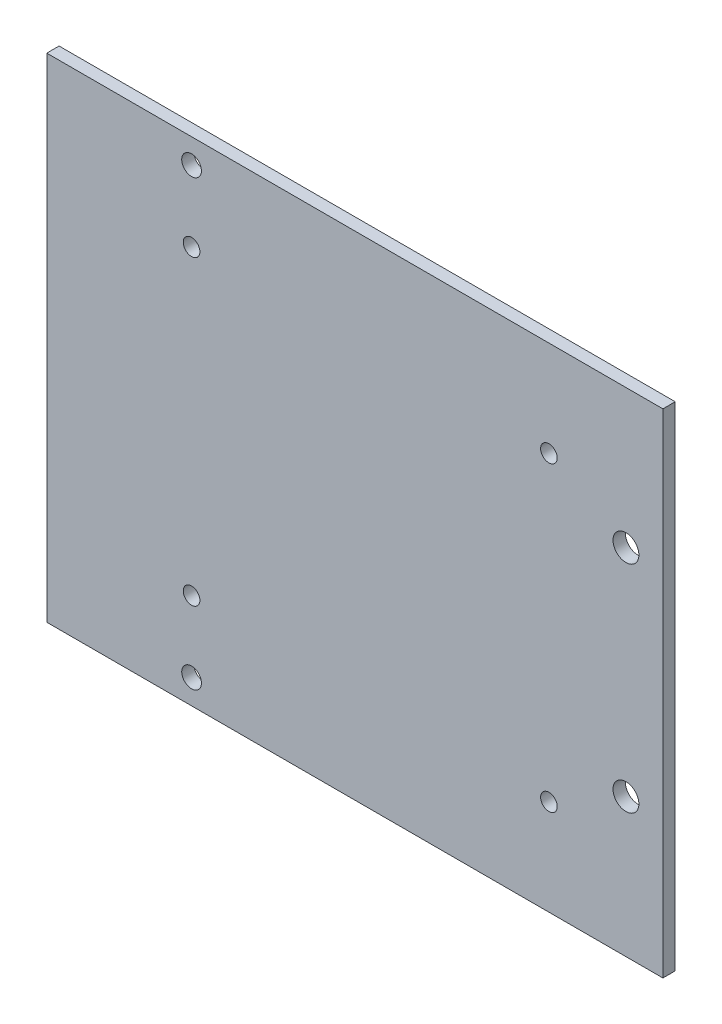
ISO-10303-21;
HEADER;
FILE_DESCRIPTION(('STEP AP214'),'2;1');
FILE_NAME('part.step','',(''),(''),'','','');
FILE_SCHEMA(('AUTOMOTIVE_DESIGN { 1 0 10303 214 1 1 1 1 }'));
ENDSEC;
DATA;
#1=APPLICATION_CONTEXT('core data for automotive mechanical design processes');
#2=APPLICATION_PROTOCOL_DEFINITION('international standard','automotive_design',2000,#1);
#3=PRODUCT_CONTEXT('',#1,'mechanical');
#4=PRODUCT('Part','Part','',(#3));
#5=PRODUCT_RELATED_PRODUCT_CATEGORY('part','',(#4));
#6=PRODUCT_DEFINITION_FORMATION('','',#4);
#7=PRODUCT_DEFINITION_CONTEXT('part definition',#1,'design');
#8=PRODUCT_DEFINITION('design','',#6,#7);
#9=PRODUCT_DEFINITION_SHAPE('','',#8);
#10=(LENGTH_UNIT() NAMED_UNIT(*) SI_UNIT(.MILLI.,.METRE.));
#11=(NAMED_UNIT(*) PLANE_ANGLE_UNIT() SI_UNIT($,.RADIAN.));
#12=(NAMED_UNIT(*) SI_UNIT($,.STERADIAN.) SOLID_ANGLE_UNIT());
#13=UNCERTAINTY_MEASURE_WITH_UNIT(LENGTH_MEASURE(1.E-05),#10,'distance_accuracy_value','');
#14=(GEOMETRIC_REPRESENTATION_CONTEXT(3) GLOBAL_UNCERTAINTY_ASSIGNED_CONTEXT((#13)) GLOBAL_UNIT_ASSIGNED_CONTEXT((#10,
#11,#12)) REPRESENTATION_CONTEXT('',''));
#15=CARTESIAN_POINT('',(0.,0.,0.));
#16=DIRECTION('',(0.,0.,1.));
#17=DIRECTION('',(1.,0.,0.));
#18=AXIS2_PLACEMENT_3D('',#15,#16,#17);
#19=CARTESIAN_POINT('',(0.,0.,2.));
#20=DIRECTION('',(0.,0.,1.));
#21=DIRECTION('',(1.,0.,0.));
#22=AXIS2_PLACEMENT_3D('',#19,#20,#21);
#23=PLANE('',#22);
#24=CARTESIAN_POINT('',(44.,-17.5,2.));
#25=DIRECTION('',(0.,0.,1.));
#26=DIRECTION('',(1.,0.,0.));
#27=AXIS2_PLACEMENT_3D('',#24,#25,#26);
#28=CIRCLE('',#27,2.09999999999999);
#29=CARTESIAN_POINT('',(46.1,-17.5,2.));
#30=VERTEX_POINT('',#29);
#31=EDGE_CURVE('E117',#30,#30,#28,.F.);
#32=ORIENTED_EDGE('',*,*,#31,.T.);
#33=EDGE_LOOP('',(#32));
#34=FACE_BOUND('',#33,.T.);
#35=CARTESIAN_POINT('',(-26.5,36.,2.));
#36=DIRECTION('',(0.,0.,1.));
#37=DIRECTION('',(1.,0.,0.));
#38=AXIS2_PLACEMENT_3D('',#35,#36,#37);
#39=CIRCLE('',#38,1.6);
#40=CARTESIAN_POINT('',(-24.9,36.,2.));
#41=VERTEX_POINT('',#40);
#42=EDGE_CURVE('E115',#41,#41,#39,.T.);
#43=ORIENTED_EDGE('',*,*,#42,.F.);
#44=EDGE_LOOP('',(#43));
#45=FACE_BOUND('',#44,.T.);
#46=CARTESIAN_POINT('',(-26.4999999999728,-36.0000000000007,2.));
#47=DIRECTION('',(0.,0.,-1.));
#48=DIRECTION('',(-1.,0.,0.));
#49=AXIS2_PLACEMENT_3D('',#46,#47,#48);
#50=CIRCLE('',#49,1.60000000001161);
#51=CARTESIAN_POINT('',(-28.0999999999844,-36.0000000000007,2.));
#52=VERTEX_POINT('',#51);
#53=EDGE_CURVE('E130',#52,#52,#50,.T.);
#54=ORIENTED_EDGE('',*,*,#53,.T.);
#55=EDGE_LOOP('',(#54));
#56=FACE_BOUND('',#55,.T.);
#57=CARTESIAN_POINT('',(-26.5,24.5,2.));
#58=DIRECTION('',(0.,0.,1.));
#59=DIRECTION('',(1.,0.,0.));
#60=AXIS2_PLACEMENT_3D('',#57,#58,#59);
#61=CIRCLE('',#60,1.35);
#62=CARTESIAN_POINT('',(-25.15,24.5,2.));
#63=VERTEX_POINT('',#62);
#64=EDGE_CURVE('E140',#63,#63,#61,.F.);
#65=ORIENTED_EDGE('',*,*,#64,.T.);
#66=EDGE_LOOP('',(#65));
#67=FACE_BOUND('',#66,.T.);
#68=CARTESIAN_POINT('',(-26.5,-24.5,2.));
#69=DIRECTION('',(0.,0.,1.));
#70=DIRECTION('',(1.,0.,0.));
#71=AXIS2_PLACEMENT_3D('',#68,#69,#70);
#72=CIRCLE('',#71,1.35);
#73=CARTESIAN_POINT('',(-25.15,-24.5,2.));
#74=VERTEX_POINT('',#73);
#75=EDGE_CURVE('E139',#74,#74,#72,.T.);
#76=ORIENTED_EDGE('',*,*,#75,.F.);
#77=EDGE_LOOP('',(#76));
#78=FACE_BOUND('',#77,.T.);
#79=DIRECTION('',(0.,1.,0.));
#80=VECTOR('',#79,1.);
#81=CARTESIAN_POINT('',(50.,40.,2.));
#82=LINE('',#81,#80);
#83=CARTESIAN_POINT('',(50.,-40.,2.));
#84=VERTEX_POINT('',#83);
#85=CARTESIAN_POINT('',(50.,40.,2.));
#86=VERTEX_POINT('',#85);
#87=EDGE_CURVE('E88',#84,#86,#82,.T.);
#88=ORIENTED_EDGE('',*,*,#87,.T.);
#89=DIRECTION('',(-1.,0.,0.));
#90=VECTOR('',#89,1.);
#91=CARTESIAN_POINT('',(-50.,40.,2.));
#92=LINE('',#91,#90);
#93=CARTESIAN_POINT('',(-50.,40.,2.));
#94=VERTEX_POINT('',#93);
#95=EDGE_CURVE('E83',#86,#94,#92,.T.);
#96=ORIENTED_EDGE('',*,*,#95,.T.);
#97=DIRECTION('',(0.,-1.,0.));
#98=VECTOR('',#97,1.);
#99=CARTESIAN_POINT('',(-50.,40.,2.));
#100=LINE('',#99,#98);
#101=CARTESIAN_POINT('',(-50.,-40.,2.));
#102=VERTEX_POINT('',#101);
#103=EDGE_CURVE('E86',#94,#102,#100,.T.);
#104=ORIENTED_EDGE('',*,*,#103,.T.);
#105=DIRECTION('',(1.,0.,0.));
#106=VECTOR('',#105,1.);
#107=CARTESIAN_POINT('',(-50.,-40.,2.));
#108=LINE('',#107,#106);
#109=EDGE_CURVE('E53',#102,#84,#108,.T.);
#110=ORIENTED_EDGE('',*,*,#109,.T.);
#111=EDGE_LOOP('',(#88,#96,#104,#110));
#112=FACE_BOUND('',#111,.T.);
#113=CARTESIAN_POINT('',(31.5,24.5,2.));
#114=DIRECTION('',(0.,0.,1.));
#115=DIRECTION('',(1.,0.,0.));
#116=AXIS2_PLACEMENT_3D('',#113,#114,#115);
#117=CIRCLE('',#116,1.35000000000001);
#118=CARTESIAN_POINT('',(32.85,24.5,2.));
#119=VERTEX_POINT('',#118);
#120=EDGE_CURVE('E146',#119,#119,#117,.T.);
#121=ORIENTED_EDGE('',*,*,#120,.F.);
#122=EDGE_LOOP('',(#121));
#123=FACE_BOUND('',#122,.T.);
#124=CARTESIAN_POINT('',(31.5,-24.5,2.));
#125=DIRECTION('',(0.,0.,1.));
#126=DIRECTION('',(1.,0.,0.));
#127=AXIS2_PLACEMENT_3D('',#124,#125,#126);
#128=CIRCLE('',#127,1.35000000000001);
#129=CARTESIAN_POINT('',(32.85,-24.5,2.));
#130=VERTEX_POINT('',#129);
#131=EDGE_CURVE('E133',#130,#130,#128,.F.);
#132=ORIENTED_EDGE('',*,*,#131,.T.);
#133=EDGE_LOOP('',(#132));
#134=FACE_BOUND('',#133,.T.);
#135=CARTESIAN_POINT('',(44.,17.5,2.));
#136=DIRECTION('',(0.,0.,1.));
#137=DIRECTION('',(1.,0.,0.));
#138=AXIS2_PLACEMENT_3D('',#135,#136,#137);
#139=CIRCLE('',#138,2.1);
#140=CARTESIAN_POINT('',(46.1,17.5,2.));
#141=VERTEX_POINT('',#140);
#142=EDGE_CURVE('E111',#141,#141,#139,.T.);
#143=ORIENTED_EDGE('',*,*,#142,.F.);
#144=EDGE_LOOP('',(#143));
#145=FACE_BOUND('',#144,.T.);
#146=ADVANCED_FACE('F34',(#34,#45,#56,#67,#78,#112,#123,#134,#145),#23,.T.);
#147=CARTESIAN_POINT('',(0.,0.,0.));
#148=DIRECTION('',(0.,0.,1.));
#149=DIRECTION('',(1.,0.,0.));
#150=AXIS2_PLACEMENT_3D('',#147,#148,#149);
#151=PLANE('',#150);
#152=CARTESIAN_POINT('',(31.5,-24.5,0.));
#153=DIRECTION('',(0.,0.,1.));
#154=DIRECTION('',(1.,0.,0.));
#155=AXIS2_PLACEMENT_3D('',#152,#153,#154);
#156=CIRCLE('',#155,1.35000000000001);
#157=CARTESIAN_POINT('',(32.85,-24.5,0.));
#158=VERTEX_POINT('',#157);
#159=EDGE_CURVE('E149',#158,#158,#156,.F.);
#160=ORIENTED_EDGE('',*,*,#159,.F.);
#161=EDGE_LOOP('',(#160));
#162=FACE_BOUND('',#161,.T.);
#163=CARTESIAN_POINT('',(-26.5,24.5,0.));
#164=DIRECTION('',(0.,0.,1.));
#165=DIRECTION('',(1.,0.,0.));
#166=AXIS2_PLACEMENT_3D('',#163,#164,#165);
#167=CIRCLE('',#166,1.35);
#168=CARTESIAN_POINT('',(-25.15,24.5,0.));
#169=VERTEX_POINT('',#168);
#170=EDGE_CURVE('E136',#169,#169,#167,.F.);
#171=ORIENTED_EDGE('',*,*,#170,.F.);
#172=EDGE_LOOP('',(#171));
#173=FACE_BOUND('',#172,.T.);
#174=DIRECTION('',(0.,1.,0.));
#175=VECTOR('',#174,1.);
#176=CARTESIAN_POINT('',(50.,40.,0.));
#177=LINE('',#176,#175);
#178=CARTESIAN_POINT('',(50.,-40.,0.));
#179=VERTEX_POINT('',#178);
#180=CARTESIAN_POINT('',(50.,40.,0.));
#181=VERTEX_POINT('',#180);
#182=EDGE_CURVE('E101',#179,#181,#177,.T.);
#183=ORIENTED_EDGE('',*,*,#182,.F.);
#184=DIRECTION('',(1.,0.,0.));
#185=VECTOR('',#184,1.);
#186=CARTESIAN_POINT('',(-50.,-40.,0.));
#187=LINE('',#186,#185);
#188=CARTESIAN_POINT('',(-50.,-40.,0.));
#189=VERTEX_POINT('',#188);
#190=EDGE_CURVE('E76',#189,#179,#187,.T.);
#191=ORIENTED_EDGE('',*,*,#190,.F.);
#192=DIRECTION('',(0.,-1.,0.));
#193=VECTOR('',#192,1.);
#194=CARTESIAN_POINT('',(-50.,40.,0.));
#195=LINE('',#194,#193);
#196=CARTESIAN_POINT('',(-50.,40.,0.));
#197=VERTEX_POINT('',#196);
#198=EDGE_CURVE('E70',#197,#189,#195,.T.);
#199=ORIENTED_EDGE('',*,*,#198,.F.);
#200=DIRECTION('',(-1.,0.,0.));
#201=VECTOR('',#200,1.);
#202=CARTESIAN_POINT('',(-50.,40.,0.));
#203=LINE('',#202,#201);
#204=EDGE_CURVE('E92',#181,#197,#203,.T.);
#205=ORIENTED_EDGE('',*,*,#204,.F.);
#206=EDGE_LOOP('',(#183,#191,#199,#205));
#207=FACE_BOUND('',#206,.T.);
#208=CARTESIAN_POINT('',(-26.5,-24.5,0.));
#209=DIRECTION('',(0.,0.,1.));
#210=DIRECTION('',(1.,0.,0.));
#211=AXIS2_PLACEMENT_3D('',#208,#209,#210);
#212=CIRCLE('',#211,1.35);
#213=CARTESIAN_POINT('',(-25.15,-24.5,0.));
#214=VERTEX_POINT('',#213);
#215=EDGE_CURVE('E104',#214,#214,#212,.T.);
#216=ORIENTED_EDGE('',*,*,#215,.T.);
#217=EDGE_LOOP('',(#216));
#218=FACE_BOUND('',#217,.T.);
#219=CARTESIAN_POINT('',(31.5,24.5,0.));
#220=DIRECTION('',(0.,0.,1.));
#221=DIRECTION('',(1.,0.,0.));
#222=AXIS2_PLACEMENT_3D('',#219,#220,#221);
#223=CIRCLE('',#222,1.35000000000001);
#224=CARTESIAN_POINT('',(32.85,24.5,0.));
#225=VERTEX_POINT('',#224);
#226=EDGE_CURVE('E143',#225,#225,#223,.T.);
#227=ORIENTED_EDGE('',*,*,#226,.T.);
#228=EDGE_LOOP('',(#227));
#229=FACE_BOUND('',#228,.T.);
#230=CARTESIAN_POINT('',(-26.4999999999728,-36.0000000000007,0.));
#231=DIRECTION('',(0.,0.,-1.));
#232=DIRECTION('',(-1.,0.,0.));
#233=AXIS2_PLACEMENT_3D('',#230,#231,#232);
#234=CIRCLE('',#233,1.60000000001161);
#235=CARTESIAN_POINT('',(-28.0999999999844,-36.0000000000007,0.));
#236=VERTEX_POINT('',#235);
#237=EDGE_CURVE('E127',#236,#236,#234,.T.);
#238=ORIENTED_EDGE('',*,*,#237,.F.);
#239=EDGE_LOOP('',(#238));
#240=FACE_BOUND('',#239,.T.);
#241=CARTESIAN_POINT('',(-26.5,36.,0.));
#242=DIRECTION('',(0.,0.,1.));
#243=DIRECTION('',(1.,0.,0.));
#244=AXIS2_PLACEMENT_3D('',#241,#242,#243);
#245=CIRCLE('',#244,1.6);
#246=CARTESIAN_POINT('',(-24.9,36.,0.));
#247=VERTEX_POINT('',#246);
#248=EDGE_CURVE('E124',#247,#247,#245,.T.);
#249=ORIENTED_EDGE('',*,*,#248,.T.);
#250=EDGE_LOOP('',(#249));
#251=FACE_BOUND('',#250,.T.);
#252=CARTESIAN_POINT('',(44.,-17.5,0.));
#253=DIRECTION('',(0.,0.,1.));
#254=DIRECTION('',(1.,0.,0.));
#255=AXIS2_PLACEMENT_3D('',#252,#253,#254);
#256=CIRCLE('',#255,2.09999999999999);
#257=CARTESIAN_POINT('',(46.1,-17.5,0.));
#258=VERTEX_POINT('',#257);
#259=EDGE_CURVE('E109',#258,#258,#256,.F.);
#260=ORIENTED_EDGE('',*,*,#259,.F.);
#261=EDGE_LOOP('',(#260));
#262=FACE_BOUND('',#261,.T.);
#263=CARTESIAN_POINT('',(44.,17.5,0.));
#264=DIRECTION('',(0.,0.,1.));
#265=DIRECTION('',(1.,0.,0.));
#266=AXIS2_PLACEMENT_3D('',#263,#264,#265);
#267=CIRCLE('',#266,2.1);
#268=CARTESIAN_POINT('',(46.1,17.5,0.));
#269=VERTEX_POINT('',#268);
#270=EDGE_CURVE('E38',#269,#269,#267,.T.);
#271=ORIENTED_EDGE('',*,*,#270,.T.);
#272=EDGE_LOOP('',(#271));
#273=FACE_BOUND('',#272,.T.);
#274=ADVANCED_FACE('F162',(#162,#173,#207,#218,#229,#240,#251,#262,#273),#151,.F.);
#275=CARTESIAN_POINT('',(50.,40.,2.));
#276=DIRECTION('',(-1.,0.,0.));
#277=DIRECTION('',(0.,-1.,0.));
#278=AXIS2_PLACEMENT_3D('',#275,#276,#277);
#279=PLANE('',#278);
#280=ORIENTED_EDGE('',*,*,#182,.T.);
#281=DIRECTION('',(0.,0.,-1.));
#282=VECTOR('',#281,1.);
#283=CARTESIAN_POINT('',(50.,40.,2.));
#284=LINE('',#283,#282);
#285=EDGE_CURVE('E11',#86,#181,#284,.T.);
#286=ORIENTED_EDGE('',*,*,#285,.F.);
#287=ORIENTED_EDGE('',*,*,#87,.F.);
#288=DIRECTION('',(0.,0.,-1.));
#289=VECTOR('',#288,1.);
#290=CARTESIAN_POINT('',(50.,-40.,2.));
#291=LINE('',#290,#289);
#292=EDGE_CURVE('E97',#84,#179,#291,.T.);
#293=ORIENTED_EDGE('',*,*,#292,.T.);
#294=EDGE_LOOP('',(#280,#286,#287,#293));
#295=FACE_BOUND('',#294,.T.);
#296=ADVANCED_FACE('F36',(#295),#279,.F.);
#297=CARTESIAN_POINT('',(-50.,40.,2.));
#298=DIRECTION('',(0.,-1.,0.));
#299=DIRECTION('',(0.,0.,-1.));
#300=AXIS2_PLACEMENT_3D('',#297,#298,#299);
#301=PLANE('',#300);
#302=ORIENTED_EDGE('',*,*,#204,.T.);
#303=DIRECTION('',(0.,0.,-1.));
#304=VECTOR('',#303,1.);
#305=CARTESIAN_POINT('',(-50.,40.,2.));
#306=LINE('',#305,#304);
#307=EDGE_CURVE('E44',#94,#197,#306,.T.);
#308=ORIENTED_EDGE('',*,*,#307,.F.);
#309=ORIENTED_EDGE('',*,*,#95,.F.);
#310=ORIENTED_EDGE('',*,*,#285,.T.);
#311=EDGE_LOOP('',(#302,#308,#309,#310));
#312=FACE_BOUND('',#311,.T.);
#313=ADVANCED_FACE('F91',(#312),#301,.F.);
#314=CARTESIAN_POINT('',(-50.,40.,2.));
#315=DIRECTION('',(1.,0.,0.));
#316=DIRECTION('',(0.,1.,0.));
#317=AXIS2_PLACEMENT_3D('',#314,#315,#316);
#318=PLANE('',#317);
#319=ORIENTED_EDGE('',*,*,#198,.T.);
#320=DIRECTION('',(0.,0.,-1.));
#321=VECTOR('',#320,1.);
#322=CARTESIAN_POINT('',(-50.,-40.,2.));
#323=LINE('',#322,#321);
#324=EDGE_CURVE('E93',#102,#189,#323,.T.);
#325=ORIENTED_EDGE('',*,*,#324,.F.);
#326=ORIENTED_EDGE('',*,*,#103,.F.);
#327=ORIENTED_EDGE('',*,*,#307,.T.);
#328=EDGE_LOOP('',(#319,#325,#326,#327));
#329=FACE_BOUND('',#328,.T.);
#330=ADVANCED_FACE('F95',(#329),#318,.F.);
#331=CARTESIAN_POINT('',(-50.,-40.,2.));
#332=DIRECTION('',(0.,1.,0.));
#333=DIRECTION('',(0.,0.,1.));
#334=AXIS2_PLACEMENT_3D('',#331,#332,#333);
#335=PLANE('',#334);
#336=ORIENTED_EDGE('',*,*,#190,.T.);
#337=ORIENTED_EDGE('',*,*,#292,.F.);
#338=ORIENTED_EDGE('',*,*,#109,.F.);
#339=ORIENTED_EDGE('',*,*,#324,.T.);
#340=EDGE_LOOP('',(#336,#337,#338,#339));
#341=FACE_BOUND('',#340,.T.);
#342=ADVANCED_FACE('F174',(#341),#335,.F.);
#343=CARTESIAN_POINT('',(-26.5,-24.5,0.));
#344=DIRECTION('',(0.,0.,1.));
#345=DIRECTION('',(1.,0.,0.));
#346=AXIS2_PLACEMENT_3D('',#343,#344,#345);
#347=CYLINDRICAL_SURFACE('',#346,1.35);
#348=ORIENTED_EDGE('',*,*,#215,.F.);
#349=EDGE_LOOP('',(#348));
#350=FACE_BOUND('',#349,.T.);
#351=ORIENTED_EDGE('',*,*,#75,.T.);
#352=EDGE_LOOP('',(#351));
#353=FACE_BOUND('',#352,.T.);
#354=ADVANCED_FACE('F159',(#350,#353),#347,.F.);
#355=CARTESIAN_POINT('',(-26.5,24.5,0.));
#356=DIRECTION('',(0.,0.,1.));
#357=DIRECTION('',(1.,0.,0.));
#358=AXIS2_PLACEMENT_3D('',#355,#356,#357);
#359=CYLINDRICAL_SURFACE('',#358,1.35);
#360=ORIENTED_EDGE('',*,*,#170,.T.);
#361=EDGE_LOOP('',(#360));
#362=FACE_BOUND('',#361,.T.);
#363=ORIENTED_EDGE('',*,*,#64,.F.);
#364=EDGE_LOOP('',(#363));
#365=FACE_BOUND('',#364,.T.);
#366=ADVANCED_FACE('F218',(#362,#365),#359,.F.);
#367=CARTESIAN_POINT('',(31.5,24.5,0.));
#368=DIRECTION('',(0.,0.,1.));
#369=DIRECTION('',(1.,0.,0.));
#370=AXIS2_PLACEMENT_3D('',#367,#368,#369);
#371=CYLINDRICAL_SURFACE('',#370,1.35000000000001);
#372=ORIENTED_EDGE('',*,*,#226,.F.);
#373=EDGE_LOOP('',(#372));
#374=FACE_BOUND('',#373,.T.);
#375=ORIENTED_EDGE('',*,*,#120,.T.);
#376=EDGE_LOOP('',(#375));
#377=FACE_BOUND('',#376,.T.);
#378=ADVANCED_FACE('F221',(#374,#377),#371,.F.);
#379=CARTESIAN_POINT('',(31.5,-24.5,0.));
#380=DIRECTION('',(0.,0.,1.));
#381=DIRECTION('',(1.,0.,0.));
#382=AXIS2_PLACEMENT_3D('',#379,#380,#381);
#383=CYLINDRICAL_SURFACE('',#382,1.35000000000001);
#384=ORIENTED_EDGE('',*,*,#159,.T.);
#385=EDGE_LOOP('',(#384));
#386=FACE_BOUND('',#385,.T.);
#387=ORIENTED_EDGE('',*,*,#131,.F.);
#388=EDGE_LOOP('',(#387));
#389=FACE_BOUND('',#388,.T.);
#390=ADVANCED_FACE('F216',(#386,#389),#383,.F.);
#391=CARTESIAN_POINT('',(-26.4999999999728,-36.0000000000007,2.));
#392=DIRECTION('',(0.,0.,-1.));
#393=DIRECTION('',(-1.,0.,0.));
#394=AXIS2_PLACEMENT_3D('',#391,#392,#393);
#395=CYLINDRICAL_SURFACE('',#394,1.60000000001161);
#396=ORIENTED_EDGE('',*,*,#53,.F.);
#397=EDGE_LOOP('',(#396));
#398=FACE_BOUND('',#397,.T.);
#399=ORIENTED_EDGE('',*,*,#237,.T.);
#400=EDGE_LOOP('',(#399));
#401=FACE_BOUND('',#400,.T.);
#402=ADVANCED_FACE('F212',(#398,#401),#395,.F.);
#403=CARTESIAN_POINT('',(-26.5,36.,0.));
#404=DIRECTION('',(0.,0.,1.));
#405=DIRECTION('',(1.,0.,0.));
#406=AXIS2_PLACEMENT_3D('',#403,#404,#405);
#407=CYLINDRICAL_SURFACE('',#406,1.6);
#408=ORIENTED_EDGE('',*,*,#248,.F.);
#409=EDGE_LOOP('',(#408));
#410=FACE_BOUND('',#409,.T.);
#411=ORIENTED_EDGE('',*,*,#42,.T.);
#412=EDGE_LOOP('',(#411));
#413=FACE_BOUND('',#412,.T.);
#414=ADVANCED_FACE('F206',(#410,#413),#407,.F.);
#415=CARTESIAN_POINT('',(44.,-17.5,-8.));
#416=DIRECTION('',(0.,0.,1.));
#417=DIRECTION('',(1.,0.,0.));
#418=AXIS2_PLACEMENT_3D('',#415,#416,#417);
#419=CYLINDRICAL_SURFACE('',#418,2.09999999999999);
#420=ORIENTED_EDGE('',*,*,#31,.F.);
#421=EDGE_LOOP('',(#420));
#422=FACE_BOUND('',#421,.T.);
#423=ORIENTED_EDGE('',*,*,#259,.T.);
#424=EDGE_LOOP('',(#423));
#425=FACE_BOUND('',#424,.T.);
#426=ADVANCED_FACE('F201',(#422,#425),#419,.F.);
#427=CARTESIAN_POINT('',(44.,17.5,-8.));
#428=DIRECTION('',(0.,0.,1.));
#429=DIRECTION('',(1.,0.,0.));
#430=AXIS2_PLACEMENT_3D('',#427,#428,#429);
#431=CYLINDRICAL_SURFACE('',#430,2.1);
#432=ORIENTED_EDGE('',*,*,#142,.T.);
#433=EDGE_LOOP('',(#432));
#434=FACE_BOUND('',#433,.T.);
#435=ORIENTED_EDGE('',*,*,#270,.F.);
#436=EDGE_LOOP('',(#435));
#437=FACE_BOUND('',#436,.T.);
#438=ADVANCED_FACE('F199',(#434,#437),#431,.F.);
#439=CLOSED_SHELL('',(#146,#274,#296,#313,#330,#342,#354,#366,#378,#390,#402,#414,#426,#438));
#440=MANIFOLD_SOLID_BREP('B2',#439);
#441=ADVANCED_BREP_SHAPE_REPRESENTATION('',(#18,#440),#14);
#442=SHAPE_DEFINITION_REPRESENTATION(#9,#441);
ENDSEC;
END-ISO-10303-21;
